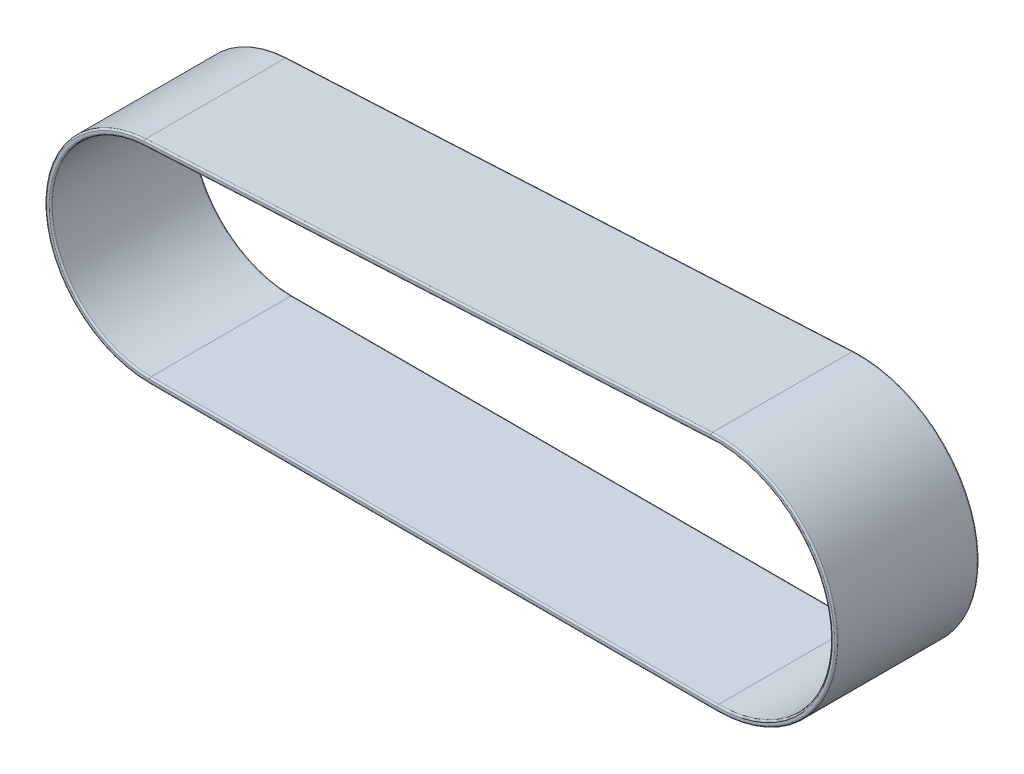
ISO-10303-21;
HEADER;
FILE_DESCRIPTION(('STEP AP214'),'2;1');
FILE_NAME('part.step','',(''),(''),'','','');
FILE_SCHEMA(('AUTOMOTIVE_DESIGN { 1 0 10303 214 1 1 1 1 }'));
ENDSEC;
DATA;
#1=APPLICATION_CONTEXT('core data for automotive mechanical design processes');
#2=APPLICATION_PROTOCOL_DEFINITION('international standard','automotive_design',2000,#1);
#3=PRODUCT_CONTEXT('',#1,'mechanical');
#4=PRODUCT('Part','Part','',(#3));
#5=PRODUCT_RELATED_PRODUCT_CATEGORY('part','',(#4));
#6=PRODUCT_DEFINITION_FORMATION('','',#4);
#7=PRODUCT_DEFINITION_CONTEXT('part definition',#1,'design');
#8=PRODUCT_DEFINITION('design','',#6,#7);
#9=PRODUCT_DEFINITION_SHAPE('','',#8);
#10=(LENGTH_UNIT() NAMED_UNIT(*) SI_UNIT(.MILLI.,.METRE.));
#11=(NAMED_UNIT(*) PLANE_ANGLE_UNIT() SI_UNIT($,.RADIAN.));
#12=(NAMED_UNIT(*) SI_UNIT($,.STERADIAN.) SOLID_ANGLE_UNIT());
#13=UNCERTAINTY_MEASURE_WITH_UNIT(LENGTH_MEASURE(1.E-05),#10,'distance_accuracy_value','');
#14=(GEOMETRIC_REPRESENTATION_CONTEXT(3) GLOBAL_UNCERTAINTY_ASSIGNED_CONTEXT((#13)) GLOBAL_UNIT_ASSIGNED_CONTEXT((#10,
#11,#12)) REPRESENTATION_CONTEXT('',''));
#15=CARTESIAN_POINT('',(0.,0.,0.));
#16=DIRECTION('',(0.,0.,1.));
#17=DIRECTION('',(1.,0.,0.));
#18=AXIS2_PLACEMENT_3D('',#15,#16,#17);
#19=CARTESIAN_POINT('',(-175.,61.,88.));
#20=DIRECTION('',(0.,0.,1.));
#21=DIRECTION('',(1.,0.,0.));
#22=AXIS2_PLACEMENT_3D('',#19,#20,#21);
#23=PLANE('',#22);
#24=DIRECTION('',(-0.998678424878244,-0.0513945880682977,0.));
#25=VECTOR('',#24,1.);
#26=CARTESIAN_POINT('',(-178.263556342337,124.416079979768,88.));
#27=LINE('',#26,#25);
#28=CARTESIAN_POINT('',(171.273892365048,142.404185803673,88.));
#29=VERTEX_POINT('',#28);
#30=CARTESIAN_POINT('',(-178.263556342337,124.416079979768,88.));
#31=VERTEX_POINT('',#30);
#32=EDGE_CURVE('E324',#29,#31,#27,.T.);
#33=ORIENTED_EDGE('',*,*,#32,.T.);
#34=CARTESIAN_POINT('',(-175.,61.,88.));
#35=DIRECTION('',(0.,0.,1.));
#36=DIRECTION('',(1.,0.,0.));
#37=AXIS2_PLACEMENT_3D('',#34,#35,#36);
#38=CIRCLE('',#37,63.5);
#39=CARTESIAN_POINT('',(-175.,-2.5,88.));
#40=VERTEX_POINT('',#39);
#41=EDGE_CURVE('E317',#31,#40,#38,.T.);
#42=ORIENTED_EDGE('',*,*,#41,.T.);
#43=DIRECTION('',(1.,0.,0.));
#44=VECTOR('',#43,1.);
#45=CARTESIAN_POINT('',(175.,-2.5,88.));
#46=LINE('',#45,#44);
#47=CARTESIAN_POINT('',(175.,-2.5,88.));
#48=VERTEX_POINT('',#47);
#49=EDGE_CURVE('E320',#40,#48,#46,.T.);
#50=ORIENTED_EDGE('',*,*,#49,.T.);
#51=CARTESIAN_POINT('',(175.,70.,88.));
#52=DIRECTION('',(0.,0.,1.));
#53=DIRECTION('',(1.,0.,0.));
#54=AXIS2_PLACEMENT_3D('',#51,#52,#53);
#55=CIRCLE('',#54,72.5);
#56=EDGE_CURVE('E327',#48,#29,#55,.T.);
#57=ORIENTED_EDGE('',*,*,#56,.T.);
#58=EDGE_LOOP('',(#33,#42,#50,#57));
#59=FACE_BOUND('',#58,.T.);
#60=CARTESIAN_POINT('',(-175.,61.,88.));
#61=DIRECTION('',(0.,0.,1.));
#62=DIRECTION('',(1.,0.,0.));
#63=AXIS2_PLACEMENT_3D('',#60,#61,#62);
#64=CIRCLE('',#63,62.);
#65=CARTESIAN_POINT('',(-175.,-1.,88.));
#66=VERTEX_POINT('',#65);
#67=CARTESIAN_POINT('',(-178.186464460234,122.918062342451,88.));
#68=VERTEX_POINT('',#67);
#69=EDGE_CURVE('E167',#66,#68,#64,.F.);
#70=ORIENTED_EDGE('',*,*,#69,.T.);
#71=DIRECTION('',(-0.998678424878244,-0.0513945880682978,0.));
#72=VECTOR('',#71,1.);
#73=CARTESIAN_POINT('',(-178.186464460234,122.918062342451,88.));
#74=LINE('',#73,#72);
#75=CARTESIAN_POINT('',(171.350984247151,140.906168166355,88.));
#76=VERTEX_POINT('',#75);
#77=EDGE_CURVE('E162',#68,#76,#74,.F.);
#78=ORIENTED_EDGE('',*,*,#77,.T.);
#79=CARTESIAN_POINT('',(175.,70.,88.));
#80=DIRECTION('',(0.,0.,1.));
#81=DIRECTION('',(1.,0.,0.));
#82=AXIS2_PLACEMENT_3D('',#79,#80,#81);
#83=CIRCLE('',#82,71.);
#84=CARTESIAN_POINT('',(175.,-0.999999999999931,88.));
#85=VERTEX_POINT('',#84);
#86=EDGE_CURVE('E157',#76,#85,#83,.F.);
#87=ORIENTED_EDGE('',*,*,#86,.T.);
#88=DIRECTION('',(1.,0.,0.));
#89=VECTOR('',#88,1.);
#90=CARTESIAN_POINT('',(-175.,-1.,88.));
#91=LINE('',#90,#89);
#92=EDGE_CURVE('E159',#85,#66,#91,.F.);
#93=ORIENTED_EDGE('',*,*,#92,.T.);
#94=EDGE_LOOP('',(#70,#78,#87,#93));
#95=FACE_BOUND('',#94,.T.);
#96=ADVANCED_FACE('F41',(#59,#95),#23,.T.);
#97=CARTESIAN_POINT('',(-175.,61.,0.));
#98=DIRECTION('',(0.,0.,1.));
#99=DIRECTION('',(1.,0.,0.));
#100=AXIS2_PLACEMENT_3D('',#97,#98,#99);
#101=PLANE('',#100);
#102=DIRECTION('',(1.,0.,0.));
#103=VECTOR('',#102,1.);
#104=CARTESIAN_POINT('',(-175.,-2.5,0.));
#105=LINE('',#104,#103);
#106=CARTESIAN_POINT('',(175.,-2.5,0.));
#107=VERTEX_POINT('',#106);
#108=CARTESIAN_POINT('',(-175.,-2.5,0.));
#109=VERTEX_POINT('',#108);
#110=EDGE_CURVE('E286',#107,#109,#105,.F.);
#111=ORIENTED_EDGE('',*,*,#110,.T.);
#112=CARTESIAN_POINT('',(-175.,61.,0.));
#113=DIRECTION('',(0.,0.,1.));
#114=DIRECTION('',(1.,0.,0.));
#115=AXIS2_PLACEMENT_3D('',#112,#113,#114);
#116=CIRCLE('',#115,63.5);
#117=CARTESIAN_POINT('',(-178.263556342337,124.416079979768,0.));
#118=VERTEX_POINT('',#117);
#119=EDGE_CURVE('E283',#109,#118,#116,.F.);
#120=ORIENTED_EDGE('',*,*,#119,.T.);
#121=DIRECTION('',(-0.998678424878244,-0.0513945880682977,0.));
#122=VECTOR('',#121,1.);
#123=CARTESIAN_POINT('',(-178.263556342337,124.416079979768,0.));
#124=LINE('',#123,#122);
#125=CARTESIAN_POINT('',(171.273892365048,142.404185803673,0.));
#126=VERTEX_POINT('',#125);
#127=EDGE_CURVE('E290',#118,#126,#124,.F.);
#128=ORIENTED_EDGE('',*,*,#127,.T.);
#129=CARTESIAN_POINT('',(175.,70.,0.));
#130=DIRECTION('',(0.,0.,1.));
#131=DIRECTION('',(1.,0.,0.));
#132=AXIS2_PLACEMENT_3D('',#129,#130,#131);
#133=CIRCLE('',#132,72.5);
#134=EDGE_CURVE('E293',#126,#107,#133,.F.);
#135=ORIENTED_EDGE('',*,*,#134,.T.);
#136=EDGE_LOOP('',(#111,#120,#128,#135));
#137=FACE_BOUND('',#136,.T.);
#138=CARTESIAN_POINT('',(175.,70.,0.));
#139=DIRECTION('',(0.,0.,1.));
#140=DIRECTION('',(1.,0.,0.));
#141=AXIS2_PLACEMENT_3D('',#138,#139,#140);
#142=CIRCLE('',#141,71.);
#143=CARTESIAN_POINT('',(175.,-0.999999999999931,0.));
#144=VERTEX_POINT('',#143);
#145=CARTESIAN_POINT('',(171.350984247151,140.906168166355,0.));
#146=VERTEX_POINT('',#145);
#147=EDGE_CURVE('E300',#144,#146,#142,.T.);
#148=ORIENTED_EDGE('',*,*,#147,.T.);
#149=DIRECTION('',(-0.998678424878244,-0.0513945880682978,0.));
#150=VECTOR('',#149,1.);
#151=CARTESIAN_POINT('',(-178.186464460234,122.918062342451,0.));
#152=LINE('',#151,#150);
#153=CARTESIAN_POINT('',(-178.186464460234,122.918062342451,0.));
#154=VERTEX_POINT('',#153);
#155=EDGE_CURVE('E296',#146,#154,#152,.T.);
#156=ORIENTED_EDGE('',*,*,#155,.T.);
#157=CARTESIAN_POINT('',(-175.,61.,0.));
#158=DIRECTION('',(0.,0.,1.));
#159=DIRECTION('',(1.,0.,0.));
#160=AXIS2_PLACEMENT_3D('',#157,#158,#159);
#161=CIRCLE('',#160,62.);
#162=CARTESIAN_POINT('',(-175.,-1.,0.));
#163=VERTEX_POINT('',#162);
#164=EDGE_CURVE('E303',#154,#163,#161,.T.);
#165=ORIENTED_EDGE('',*,*,#164,.T.);
#166=DIRECTION('',(1.,0.,0.));
#167=VECTOR('',#166,1.);
#168=CARTESIAN_POINT('',(175.,-0.999999999999931,0.));
#169=LINE('',#168,#167);
#170=EDGE_CURVE('E306',#163,#144,#169,.T.);
#171=ORIENTED_EDGE('',*,*,#170,.T.);
#172=EDGE_LOOP('',(#148,#156,#165,#171));
#173=FACE_BOUND('',#172,.T.);
#174=ADVANCED_FACE('F373',(#137,#173),#101,.F.);
#175=CARTESIAN_POINT('',(-175.,61.,88.));
#176=DIRECTION('',(0.,0.,-1.));
#177=DIRECTION('',(-1.,0.,0.));
#178=AXIS2_PLACEMENT_3D('',#175,#176,#177);
#179=CYLINDRICAL_SURFACE('',#178,64.5);
#180=DIRECTION('',(0.,0.,-1.));
#181=VECTOR('',#180,1.);
#182=CARTESIAN_POINT('',(-175.,-3.5,88.));
#183=LINE('',#182,#181);
#184=CARTESIAN_POINT('',(-175.,-3.5,87.));
#185=VERTEX_POINT('',#184);
#186=CARTESIAN_POINT('',(-175.,-3.5,1.));
#187=VERTEX_POINT('',#186);
#188=EDGE_CURVE('E179',#185,#187,#183,.T.);
#189=ORIENTED_EDGE('',*,*,#188,.F.);
#190=CARTESIAN_POINT('',(-175.,61.,87.));
#191=DIRECTION('',(0.,0.,1.));
#192=DIRECTION('',(1.,0.,0.));
#193=AXIS2_PLACEMENT_3D('',#190,#191,#192);
#194=CIRCLE('',#193,64.5);
#195=CARTESIAN_POINT('',(-178.314950930405,125.414758404647,87.));
#196=VERTEX_POINT('',#195);
#197=EDGE_CURVE('E258',#185,#196,#194,.F.);
#198=ORIENTED_EDGE('',*,*,#197,.T.);
#199=DIRECTION('',(0.,0.,-1.));
#200=VECTOR('',#199,1.);
#201=CARTESIAN_POINT('',(-178.314950930405,125.414758404647,88.));
#202=LINE('',#201,#200);
#203=CARTESIAN_POINT('',(-178.314950930405,125.414758404647,1.));
#204=VERTEX_POINT('',#203);
#205=EDGE_CURVE('E345',#196,#204,#202,.T.);
#206=ORIENTED_EDGE('',*,*,#205,.T.);
#207=CARTESIAN_POINT('',(-175.,61.,1.));
#208=DIRECTION('',(0.,0.,1.));
#209=DIRECTION('',(1.,0.,0.));
#210=AXIS2_PLACEMENT_3D('',#207,#208,#209);
#211=CIRCLE('',#210,64.5);
#212=EDGE_CURVE('E261',#204,#187,#211,.T.);
#213=ORIENTED_EDGE('',*,*,#212,.T.);
#214=EDGE_LOOP('',(#189,#198,#206,#213));
#215=FACE_BOUND('',#214,.T.);
#216=ADVANCED_FACE('F394',(#215),#179,.T.);
#217=CARTESIAN_POINT('',(-175.,-3.5,88.));
#218=DIRECTION('',(0.,1.,0.));
#219=DIRECTION('',(0.,0.,1.));
#220=AXIS2_PLACEMENT_3D('',#217,#218,#219);
#221=PLANE('',#220);
#222=DIRECTION('',(0.,0.,-1.));
#223=VECTOR('',#222,1.);
#224=CARTESIAN_POINT('',(175.,-3.5,88.));
#225=LINE('',#224,#223);
#226=CARTESIAN_POINT('',(175.,-3.5,87.));
#227=VERTEX_POINT('',#226);
#228=CARTESIAN_POINT('',(175.,-3.5,1.));
#229=VERTEX_POINT('',#228);
#230=EDGE_CURVE('E337',#227,#229,#225,.T.);
#231=ORIENTED_EDGE('',*,*,#230,.F.);
#232=DIRECTION('',(1.,0.,0.));
#233=VECTOR('',#232,1.);
#234=CARTESIAN_POINT('',(-175.,-3.5,87.));
#235=LINE('',#234,#233);
#236=EDGE_CURVE('E309',#227,#185,#235,.F.);
#237=ORIENTED_EDGE('',*,*,#236,.T.);
#238=ORIENTED_EDGE('',*,*,#188,.T.);
#239=DIRECTION('',(1.,0.,0.));
#240=VECTOR('',#239,1.);
#241=CARTESIAN_POINT('',(-175.,-3.5,1.));
#242=LINE('',#241,#240);
#243=EDGE_CURVE('E313',#187,#229,#242,.T.);
#244=ORIENTED_EDGE('',*,*,#243,.T.);
#245=EDGE_LOOP('',(#231,#237,#238,#244));
#246=FACE_BOUND('',#245,.T.);
#247=ADVANCED_FACE('F408',(#246),#221,.F.);
#248=CARTESIAN_POINT('',(175.,70.,88.));
#249=DIRECTION('',(0.,0.,-1.));
#250=DIRECTION('',(-1.,0.,0.));
#251=AXIS2_PLACEMENT_3D('',#248,#249,#250);
#252=CYLINDRICAL_SURFACE('',#251,73.5);
#253=DIRECTION('',(0.,0.,-1.));
#254=VECTOR('',#253,1.);
#255=CARTESIAN_POINT('',(171.22249777698,143.402864228551,88.));
#256=LINE('',#255,#254);
#257=CARTESIAN_POINT('',(171.22249777698,143.402864228551,87.));
#258=VERTEX_POINT('',#257);
#259=CARTESIAN_POINT('',(171.22249777698,143.402864228551,1.));
#260=VERTEX_POINT('',#259);
#261=EDGE_CURVE('E341',#258,#260,#256,.T.);
#262=ORIENTED_EDGE('',*,*,#261,.F.);
#263=CARTESIAN_POINT('',(175.,70.,87.));
#264=DIRECTION('',(0.,0.,1.));
#265=DIRECTION('',(1.,0.,0.));
#266=AXIS2_PLACEMENT_3D('',#263,#264,#265);
#267=CIRCLE('',#266,73.5);
#268=EDGE_CURVE('E252',#258,#227,#267,.F.);
#269=ORIENTED_EDGE('',*,*,#268,.T.);
#270=ORIENTED_EDGE('',*,*,#230,.T.);
#271=CARTESIAN_POINT('',(175.,70.,1.));
#272=DIRECTION('',(0.,0.,1.));
#273=DIRECTION('',(1.,0.,0.));
#274=AXIS2_PLACEMENT_3D('',#271,#272,#273);
#275=CIRCLE('',#274,73.5);
#276=EDGE_CURVE('E255',#229,#260,#275,.T.);
#277=ORIENTED_EDGE('',*,*,#276,.T.);
#278=EDGE_LOOP('',(#262,#269,#270,#277));
#279=FACE_BOUND('',#278,.T.);
#280=ADVANCED_FACE('F404',(#279),#252,.T.);
#281=CARTESIAN_POINT('',(171.22249777698,143.402864228551,88.));
#282=DIRECTION('',(0.0513945880682977,-0.998678424878244,0.));
#283=DIRECTION('',(0.998678424878244,0.0513945880682977,0.));
#284=AXIS2_PLACEMENT_3D('',#281,#282,#283);
#285=PLANE('',#284);
#286=ORIENTED_EDGE('',*,*,#205,.F.);
#287=DIRECTION('',(-0.998678424878244,-0.0513945880682977,0.));
#288=VECTOR('',#287,1.);
#289=CARTESIAN_POINT('',(171.22249777698,143.402864228551,87.));
#290=LINE('',#289,#288);
#291=EDGE_CURVE('E269',#196,#258,#290,.F.);
#292=ORIENTED_EDGE('',*,*,#291,.T.);
#293=ORIENTED_EDGE('',*,*,#261,.T.);
#294=DIRECTION('',(-0.998678424878244,-0.0513945880682977,0.));
#295=VECTOR('',#294,1.);
#296=CARTESIAN_POINT('',(171.22249777698,143.402864228551,1.));
#297=LINE('',#296,#295);
#298=EDGE_CURVE('E272',#260,#204,#297,.T.);
#299=ORIENTED_EDGE('',*,*,#298,.T.);
#300=EDGE_LOOP('',(#286,#292,#293,#299));
#301=FACE_BOUND('',#300,.T.);
#302=ADVANCED_FACE('F401',(#301),#285,.F.);
#303=CARTESIAN_POINT('',(-175.,61.,88.));
#304=DIRECTION('',(0.,0.,-1.));
#305=DIRECTION('',(-1.,0.,0.));
#306=AXIS2_PLACEMENT_3D('',#303,#304,#305);
#307=CYLINDRICAL_SURFACE('',#306,61.);
#308=DIRECTION('',(0.,0.,-1.));
#309=VECTOR('',#308,1.);
#310=CARTESIAN_POINT('',(-178.135069872166,121.919383917573,88.));
#311=LINE('',#310,#309);
#312=CARTESIAN_POINT('',(-178.135069872166,121.919383917573,87.));
#313=VERTEX_POINT('',#312);
#314=CARTESIAN_POINT('',(-178.135069872166,121.919383917573,1.));
#315=VERTEX_POINT('',#314);
#316=EDGE_CURVE('E235',#313,#315,#311,.T.);
#317=ORIENTED_EDGE('',*,*,#316,.F.);
#318=CARTESIAN_POINT('',(-175.,61.,87.));
#319=DIRECTION('',(0.,0.,1.));
#320=DIRECTION('',(1.,0.,0.));
#321=AXIS2_PLACEMENT_3D('',#318,#319,#320);
#322=CIRCLE('',#321,61.);
#323=CARTESIAN_POINT('',(-175.,0.,87.));
#324=VERTEX_POINT('',#323);
#325=EDGE_CURVE('E65',#313,#324,#322,.T.);
#326=ORIENTED_EDGE('',*,*,#325,.T.);
#327=DIRECTION('',(0.,0.,-1.));
#328=VECTOR('',#327,1.);
#329=CARTESIAN_POINT('',(-175.,0.,88.));
#330=LINE('',#329,#328);
#331=CARTESIAN_POINT('',(-175.,0.,1.));
#332=VERTEX_POINT('',#331);
#333=EDGE_CURVE('E349',#324,#332,#330,.T.);
#334=ORIENTED_EDGE('',*,*,#333,.T.);
#335=CARTESIAN_POINT('',(-175.,61.,1.));
#336=DIRECTION('',(0.,0.,1.));
#337=DIRECTION('',(1.,0.,0.));
#338=AXIS2_PLACEMENT_3D('',#335,#336,#337);
#339=CIRCLE('',#338,61.);
#340=EDGE_CURVE('E249',#332,#315,#339,.F.);
#341=ORIENTED_EDGE('',*,*,#340,.T.);
#342=EDGE_LOOP('',(#317,#326,#334,#341));
#343=FACE_BOUND('',#342,.T.);
#344=ADVANCED_FACE('F398',(#343),#307,.F.);
#345=CARTESIAN_POINT('',(-175.,0.,88.));
#346=DIRECTION('',(0.,1.,0.));
#347=DIRECTION('',(-1.,0.,0.));
#348=AXIS2_PLACEMENT_3D('',#345,#346,#347);
#349=PLANE('',#348);
#350=ORIENTED_EDGE('',*,*,#333,.F.);
#351=DIRECTION('',(1.,0.,0.));
#352=VECTOR('',#351,1.);
#353=CARTESIAN_POINT('',(-175.,0.,87.));
#354=LINE('',#353,#352);
#355=CARTESIAN_POINT('',(175.,0.,87.));
#356=VERTEX_POINT('',#355);
#357=EDGE_CURVE('E11',#324,#356,#354,.T.);
#358=ORIENTED_EDGE('',*,*,#357,.T.);
#359=DIRECTION('',(0.,0.,-1.));
#360=VECTOR('',#359,1.);
#361=CARTESIAN_POINT('',(175.,0.,88.));
#362=LINE('',#361,#360);
#363=CARTESIAN_POINT('',(175.,0.,1.));
#364=VERTEX_POINT('',#363);
#365=EDGE_CURVE('E352',#356,#364,#362,.T.);
#366=ORIENTED_EDGE('',*,*,#365,.T.);
#367=DIRECTION('',(1.,0.,0.));
#368=VECTOR('',#367,1.);
#369=CARTESIAN_POINT('',(-175.,0.,1.));
#370=LINE('',#369,#368);
#371=EDGE_CURVE('E51',#364,#332,#370,.F.);
#372=ORIENTED_EDGE('',*,*,#371,.T.);
#373=EDGE_LOOP('',(#350,#358,#366,#372));
#374=FACE_BOUND('',#373,.T.);
#375=ADVANCED_FACE('F378',(#374),#349,.T.);
#376=CARTESIAN_POINT('',(175.,70.,88.));
#377=DIRECTION('',(0.,0.,-1.));
#378=DIRECTION('',(-1.,0.,0.));
#379=AXIS2_PLACEMENT_3D('',#376,#377,#378);
#380=CYLINDRICAL_SURFACE('',#379,70.);
#381=ORIENTED_EDGE('',*,*,#365,.F.);
#382=CARTESIAN_POINT('',(175.,70.,87.));
#383=DIRECTION('',(0.,0.,1.));
#384=DIRECTION('',(1.,0.,0.));
#385=AXIS2_PLACEMENT_3D('',#382,#383,#384);
#386=CIRCLE('',#385,70.);
#387=CARTESIAN_POINT('',(171.402378835219,139.907489741477,87.));
#388=VERTEX_POINT('',#387);
#389=EDGE_CURVE('E182',#356,#388,#386,.T.);
#390=ORIENTED_EDGE('',*,*,#389,.T.);
#391=DIRECTION('',(0.,0.,-1.));
#392=VECTOR('',#391,1.);
#393=CARTESIAN_POINT('',(171.402378835219,139.907489741477,88.));
#394=LINE('',#393,#392);
#395=CARTESIAN_POINT('',(171.402378835219,139.907489741477,1.));
#396=VERTEX_POINT('',#395);
#397=EDGE_CURVE('E355',#388,#396,#394,.T.);
#398=ORIENTED_EDGE('',*,*,#397,.T.);
#399=CARTESIAN_POINT('',(175.,70.,1.));
#400=DIRECTION('',(0.,0.,1.));
#401=DIRECTION('',(1.,0.,0.));
#402=AXIS2_PLACEMENT_3D('',#399,#400,#401);
#403=CIRCLE('',#402,70.);
#404=EDGE_CURVE('E266',#396,#364,#403,.F.);
#405=ORIENTED_EDGE('',*,*,#404,.T.);
#406=EDGE_LOOP('',(#381,#390,#398,#405));
#407=FACE_BOUND('',#406,.T.);
#408=ADVANCED_FACE('F377',(#407),#380,.F.);
#409=CARTESIAN_POINT('',(171.402378835219,139.907489741477,88.));
#410=DIRECTION('',(0.0513945880682978,-0.998678424878244,0.));
#411=DIRECTION('',(0.998678424878244,0.0513945880682978,0.));
#412=AXIS2_PLACEMENT_3D('',#409,#410,#411);
#413=PLANE('',#412);
#414=ORIENTED_EDGE('',*,*,#397,.F.);
#415=DIRECTION('',(-0.998678424878244,-0.0513945880682978,0.));
#416=VECTOR('',#415,1.);
#417=CARTESIAN_POINT('',(171.402378835219,139.907489741477,87.));
#418=LINE('',#417,#416);
#419=EDGE_CURVE('E275',#388,#313,#418,.T.);
#420=ORIENTED_EDGE('',*,*,#419,.T.);
#421=ORIENTED_EDGE('',*,*,#316,.T.);
#422=DIRECTION('',(-0.998678424878244,-0.0513945880682978,0.));
#423=VECTOR('',#422,1.);
#424=CARTESIAN_POINT('',(171.402378835219,139.907489741477,1.));
#425=LINE('',#424,#423);
#426=EDGE_CURVE('E279',#315,#396,#425,.F.);
#427=ORIENTED_EDGE('',*,*,#426,.T.);
#428=EDGE_LOOP('',(#414,#420,#421,#427));
#429=FACE_BOUND('',#428,.T.);
#430=ADVANCED_FACE('F364',(#429),#413,.T.);
#431=CARTESIAN_POINT('',(-178.263556342337,124.416079979768,87.));
#432=DIRECTION('',(0.998678424878244,0.0513945880682977,0.));
#433=DIRECTION('',(-0.0513945880682977,0.998678424878244,0.));
#434=AXIS2_PLACEMENT_3D('',#431,#432,#433);
#435=CYLINDRICAL_SURFACE('',#434,1.);
#436=CARTESIAN_POINT('',(171.273892365048,142.404185803673,87.));
#437=DIRECTION('',(0.998678424878244,0.0513945880682985,0.));
#438=DIRECTION('',(-0.0513945880682985,0.998678424878244,0.));
#439=AXIS2_PLACEMENT_3D('',#436,#437,#438);
#440=CIRCLE('',#439,1.);
#441=EDGE_CURVE('E236',#258,#29,#440,.T.);
#442=ORIENTED_EDGE('',*,*,#441,.F.);
#443=ORIENTED_EDGE('',*,*,#291,.F.);
#444=CARTESIAN_POINT('',(-178.263556342337,124.416079979768,87.));
#445=DIRECTION('',(-0.998678424878244,-0.0513945880682985,0.));
#446=DIRECTION('',(0.0513945880682985,-0.998678424878244,0.));
#447=AXIS2_PLACEMENT_3D('',#444,#445,#446);
#448=CIRCLE('',#447,1.);
#449=EDGE_CURVE('E231',#31,#196,#448,.T.);
#450=ORIENTED_EDGE('',*,*,#449,.F.);
#451=ORIENTED_EDGE('',*,*,#32,.F.);
#452=EDGE_LOOP('',(#442,#443,#450,#451));
#453=FACE_BOUND('',#452,.T.);
#454=ADVANCED_FACE('F428',(#453),#435,.T.);
#455=CARTESIAN_POINT('',(-175.,61.,87.));
#456=DIRECTION('',(0.,0.,1.));
#457=DIRECTION('',(1.,0.,0.));
#458=AXIS2_PLACEMENT_3D('',#455,#456,#457);
#459=TOROIDAL_SURFACE('',#458,63.5,1.);
#460=ORIENTED_EDGE('',*,*,#449,.T.);
#461=ORIENTED_EDGE('',*,*,#197,.F.);
#462=CARTESIAN_POINT('',(-175.,-2.5,87.));
#463=DIRECTION('',(1.,0.,0.));
#464=DIRECTION('',(0.,0.,-1.));
#465=AXIS2_PLACEMENT_3D('',#462,#463,#464);
#466=CIRCLE('',#465,1.);
#467=EDGE_CURVE('E240',#40,#185,#466,.T.);
#468=ORIENTED_EDGE('',*,*,#467,.F.);
#469=ORIENTED_EDGE('',*,*,#41,.F.);
#470=EDGE_LOOP('',(#460,#461,#468,#469));
#471=FACE_BOUND('',#470,.T.);
#472=ADVANCED_FACE('F424',(#471),#459,.T.);
#473=CARTESIAN_POINT('',(175.,70.,87.));
#474=DIRECTION('',(0.,0.,1.));
#475=DIRECTION('',(1.,0.,0.));
#476=AXIS2_PLACEMENT_3D('',#473,#474,#475);
#477=TOROIDAL_SURFACE('',#476,72.5,1.);
#478=ORIENTED_EDGE('',*,*,#441,.T.);
#479=ORIENTED_EDGE('',*,*,#56,.F.);
#480=CARTESIAN_POINT('',(175.,-2.5,87.));
#481=DIRECTION('',(-1.,0.,0.));
#482=DIRECTION('',(0.,0.,1.));
#483=AXIS2_PLACEMENT_3D('',#480,#481,#482);
#484=CIRCLE('',#483,1.);
#485=EDGE_CURVE('E224',#227,#48,#484,.T.);
#486=ORIENTED_EDGE('',*,*,#485,.F.);
#487=ORIENTED_EDGE('',*,*,#268,.F.);
#488=EDGE_LOOP('',(#478,#479,#486,#487));
#489=FACE_BOUND('',#488,.T.);
#490=ADVANCED_FACE('F420',(#489),#477,.T.);
#491=CARTESIAN_POINT('',(-175.,-2.5,87.));
#492=DIRECTION('',(-1.,0.,0.));
#493=DIRECTION('',(0.,0.,1.));
#494=AXIS2_PLACEMENT_3D('',#491,#492,#493);
#495=CYLINDRICAL_SURFACE('',#494,1.);
#496=ORIENTED_EDGE('',*,*,#467,.T.);
#497=ORIENTED_EDGE('',*,*,#236,.F.);
#498=ORIENTED_EDGE('',*,*,#485,.T.);
#499=ORIENTED_EDGE('',*,*,#49,.F.);
#500=EDGE_LOOP('',(#496,#497,#498,#499));
#501=FACE_BOUND('',#500,.T.);
#502=ADVANCED_FACE('F416',(#501),#495,.T.);
#503=CARTESIAN_POINT('',(171.273892365048,142.404185803673,1.));
#504=DIRECTION('',(-0.998678424878244,-0.0513945880682977,0.));
#505=DIRECTION('',(0.0513945880682977,-0.998678424878244,0.));
#506=AXIS2_PLACEMENT_3D('',#503,#504,#505);
#507=CYLINDRICAL_SURFACE('',#506,1.);
#508=CARTESIAN_POINT('',(171.273892365048,142.404185803673,1.));
#509=DIRECTION('',(0.998678424878244,0.0513945880682985,0.));
#510=DIRECTION('',(-0.0513945880682985,0.998678424878244,0.));
#511=AXIS2_PLACEMENT_3D('',#508,#509,#510);
#512=CIRCLE('',#511,1.);
#513=EDGE_CURVE('E225',#126,#260,#512,.T.);
#514=ORIENTED_EDGE('',*,*,#513,.F.);
#515=ORIENTED_EDGE('',*,*,#127,.F.);
#516=CARTESIAN_POINT('',(-178.263556342337,124.416079979768,1.));
#517=DIRECTION('',(-0.998678424878244,-0.0513945880682985,0.));
#518=DIRECTION('',(0.0513945880682985,-0.998678424878244,0.));
#519=AXIS2_PLACEMENT_3D('',#516,#517,#518);
#520=CIRCLE('',#519,1.);
#521=EDGE_CURVE('E220',#204,#118,#520,.T.);
#522=ORIENTED_EDGE('',*,*,#521,.F.);
#523=ORIENTED_EDGE('',*,*,#298,.F.);
#524=EDGE_LOOP('',(#514,#515,#522,#523));
#525=FACE_BOUND('',#524,.T.);
#526=ADVANCED_FACE('F419',(#525),#507,.T.);
#527=CARTESIAN_POINT('',(-175.,61.,1.));
#528=DIRECTION('',(0.,0.,1.));
#529=DIRECTION('',(1.,0.,0.));
#530=AXIS2_PLACEMENT_3D('',#527,#528,#529);
#531=TOROIDAL_SURFACE('',#530,63.5,1.);
#532=ORIENTED_EDGE('',*,*,#521,.T.);
#533=ORIENTED_EDGE('',*,*,#119,.F.);
#534=CARTESIAN_POINT('',(-175.,-2.5,1.));
#535=DIRECTION('',(1.,0.,0.));
#536=DIRECTION('',(0.,0.,-1.));
#537=AXIS2_PLACEMENT_3D('',#534,#535,#536);
#538=CIRCLE('',#537,1.);
#539=EDGE_CURVE('E188',#187,#109,#538,.T.);
#540=ORIENTED_EDGE('',*,*,#539,.F.);
#541=ORIENTED_EDGE('',*,*,#212,.F.);
#542=EDGE_LOOP('',(#532,#533,#540,#541));
#543=FACE_BOUND('',#542,.T.);
#544=ADVANCED_FACE('F440',(#543),#531,.T.);
#545=CARTESIAN_POINT('',(175.,70.,1.));
#546=DIRECTION('',(0.,0.,1.));
#547=DIRECTION('',(1.,0.,0.));
#548=AXIS2_PLACEMENT_3D('',#545,#546,#547);
#549=TOROIDAL_SURFACE('',#548,72.5,1.);
#550=ORIENTED_EDGE('',*,*,#513,.T.);
#551=ORIENTED_EDGE('',*,*,#276,.F.);
#552=CARTESIAN_POINT('',(175.,-2.5,1.));
#553=DIRECTION('',(-1.,0.,0.));
#554=DIRECTION('',(0.,0.,1.));
#555=AXIS2_PLACEMENT_3D('',#552,#553,#554);
#556=CIRCLE('',#555,1.);
#557=EDGE_CURVE('E184',#107,#229,#556,.T.);
#558=ORIENTED_EDGE('',*,*,#557,.F.);
#559=ORIENTED_EDGE('',*,*,#134,.F.);
#560=EDGE_LOOP('',(#550,#551,#558,#559));
#561=FACE_BOUND('',#560,.T.);
#562=ADVANCED_FACE('F436',(#561),#549,.T.);
#563=CARTESIAN_POINT('',(-175.,-2.5,1.));
#564=DIRECTION('',(1.,0.,0.));
#565=DIRECTION('',(0.,0.,-1.));
#566=AXIS2_PLACEMENT_3D('',#563,#564,#565);
#567=CYLINDRICAL_SURFACE('',#566,1.);
#568=ORIENTED_EDGE('',*,*,#539,.T.);
#569=ORIENTED_EDGE('',*,*,#110,.F.);
#570=ORIENTED_EDGE('',*,*,#557,.T.);
#571=ORIENTED_EDGE('',*,*,#243,.F.);
#572=EDGE_LOOP('',(#568,#569,#570,#571));
#573=FACE_BOUND('',#572,.T.);
#574=ADVANCED_FACE('F433',(#573),#567,.T.);
#575=CARTESIAN_POINT('',(-175.,-1.,87.));
#576=DIRECTION('',(1.,0.,0.));
#577=DIRECTION('',(0.,1.,0.));
#578=AXIS2_PLACEMENT_3D('',#575,#576,#577);
#579=CYLINDRICAL_SURFACE('',#578,1.);
#580=CARTESIAN_POINT('',(-175.,-1.,87.));
#581=DIRECTION('',(-1.,0.,0.));
#582=DIRECTION('',(0.,0.,1.));
#583=AXIS2_PLACEMENT_3D('',#580,#581,#582);
#584=CIRCLE('',#583,1.);
#585=EDGE_CURVE('E176',#66,#324,#584,.T.);
#586=ORIENTED_EDGE('',*,*,#585,.F.);
#587=ORIENTED_EDGE('',*,*,#92,.F.);
#588=CARTESIAN_POINT('',(175.,-0.999999999999931,87.));
#589=DIRECTION('',(1.,0.,0.));
#590=DIRECTION('',(0.,0.,-1.));
#591=AXIS2_PLACEMENT_3D('',#588,#589,#590);
#592=CIRCLE('',#591,1.);
#593=EDGE_CURVE('E173',#356,#85,#592,.T.);
#594=ORIENTED_EDGE('',*,*,#593,.F.);
#595=ORIENTED_EDGE('',*,*,#357,.F.);
#596=EDGE_LOOP('',(#586,#587,#594,#595));
#597=FACE_BOUND('',#596,.T.);
#598=ADVANCED_FACE('F171',(#597),#579,.T.);
#599=CARTESIAN_POINT('',(175.,70.,87.));
#600=DIRECTION('',(0.,0.,1.));
#601=DIRECTION('',(1.,0.,0.));
#602=AXIS2_PLACEMENT_3D('',#599,#600,#601);
#603=TOROIDAL_SURFACE('',#602,71.,1.);
#604=ORIENTED_EDGE('',*,*,#593,.T.);
#605=ORIENTED_EDGE('',*,*,#86,.F.);
#606=CARTESIAN_POINT('',(171.350984247151,140.906168166355,87.));
#607=DIRECTION('',(-0.998678424878244,-0.0513945880682985,0.));
#608=DIRECTION('',(0.0513945880682985,-0.998678424878244,0.));
#609=AXIS2_PLACEMENT_3D('',#606,#607,#608);
#610=CIRCLE('',#609,1.);
#611=EDGE_CURVE('E190',#388,#76,#610,.T.);
#612=ORIENTED_EDGE('',*,*,#611,.F.);
#613=ORIENTED_EDGE('',*,*,#389,.F.);
#614=EDGE_LOOP('',(#604,#605,#612,#613));
#615=FACE_BOUND('',#614,.T.);
#616=ADVANCED_FACE('F181',(#615),#603,.T.);
#617=CARTESIAN_POINT('',(-175.,61.,87.));
#618=DIRECTION('',(0.,0.,1.));
#619=DIRECTION('',(1.,0.,0.));
#620=AXIS2_PLACEMENT_3D('',#617,#618,#619);
#621=TOROIDAL_SURFACE('',#620,62.,1.);
#622=ORIENTED_EDGE('',*,*,#585,.T.);
#623=ORIENTED_EDGE('',*,*,#325,.F.);
#624=CARTESIAN_POINT('',(-178.186464460234,122.918062342451,87.));
#625=DIRECTION('',(0.998678424878244,0.0513945880682992,0.));
#626=DIRECTION('',(-0.0513945880682992,0.998678424878244,0.));
#627=AXIS2_PLACEMENT_3D('',#624,#625,#626);
#628=CIRCLE('',#627,1.);
#629=EDGE_CURVE('E208',#68,#313,#628,.T.);
#630=ORIENTED_EDGE('',*,*,#629,.F.);
#631=ORIENTED_EDGE('',*,*,#69,.F.);
#632=EDGE_LOOP('',(#622,#623,#630,#631));
#633=FACE_BOUND('',#632,.T.);
#634=ADVANCED_FACE('F386',(#633),#621,.T.);
#635=CARTESIAN_POINT('',(171.350984247151,140.906168166355,87.));
#636=DIRECTION('',(-0.998678424878244,-0.0513945880682978,0.));
#637=DIRECTION('',(0.0513945880682978,-0.998678424878244,0.));
#638=AXIS2_PLACEMENT_3D('',#635,#636,#637);
#639=CYLINDRICAL_SURFACE('',#638,1.);
#640=ORIENTED_EDGE('',*,*,#611,.T.);
#641=ORIENTED_EDGE('',*,*,#77,.F.);
#642=ORIENTED_EDGE('',*,*,#629,.T.);
#643=ORIENTED_EDGE('',*,*,#419,.F.);
#644=EDGE_LOOP('',(#640,#641,#642,#643));
#645=FACE_BOUND('',#644,.T.);
#646=ADVANCED_FACE('F381',(#645),#639,.T.);
#647=CARTESIAN_POINT('',(-175.,-1.,1.));
#648=DIRECTION('',(-1.,0.,0.));
#649=DIRECTION('',(0.,-1.,0.));
#650=AXIS2_PLACEMENT_3D('',#647,#648,#649);
#651=CYLINDRICAL_SURFACE('',#650,1.);
#652=CARTESIAN_POINT('',(-175.,-1.,1.));
#653=DIRECTION('',(-1.,0.,0.));
#654=DIRECTION('',(0.,0.,1.));
#655=AXIS2_PLACEMENT_3D('',#652,#653,#654);
#656=CIRCLE('',#655,1.);
#657=EDGE_CURVE('E199',#332,#163,#656,.T.);
#658=ORIENTED_EDGE('',*,*,#657,.F.);
#659=ORIENTED_EDGE('',*,*,#371,.F.);
#660=CARTESIAN_POINT('',(175.,-0.999999999999931,1.));
#661=DIRECTION('',(1.,0.,0.));
#662=DIRECTION('',(0.,0.,-1.));
#663=AXIS2_PLACEMENT_3D('',#660,#661,#662);
#664=CIRCLE('',#663,1.);
#665=EDGE_CURVE('E45',#144,#364,#664,.T.);
#666=ORIENTED_EDGE('',*,*,#665,.F.);
#667=ORIENTED_EDGE('',*,*,#170,.F.);
#668=EDGE_LOOP('',(#658,#659,#666,#667));
#669=FACE_BOUND('',#668,.T.);
#670=ADVANCED_FACE('F43',(#669),#651,.T.);
#671=CARTESIAN_POINT('',(175.,70.,1.));
#672=DIRECTION('',(0.,0.,1.));
#673=DIRECTION('',(1.,0.,0.));
#674=AXIS2_PLACEMENT_3D('',#671,#672,#673);
#675=TOROIDAL_SURFACE('',#674,71.,1.);
#676=ORIENTED_EDGE('',*,*,#665,.T.);
#677=ORIENTED_EDGE('',*,*,#404,.F.);
#678=CARTESIAN_POINT('',(171.350984247151,140.906168166355,1.));
#679=DIRECTION('',(-0.998678424878244,-0.0513945880682985,0.));
#680=DIRECTION('',(0.0513945880682985,-0.998678424878244,0.));
#681=AXIS2_PLACEMENT_3D('',#678,#679,#680);
#682=CIRCLE('',#681,1.);
#683=EDGE_CURVE('E197',#146,#396,#682,.T.);
#684=ORIENTED_EDGE('',*,*,#683,.F.);
#685=ORIENTED_EDGE('',*,*,#147,.F.);
#686=EDGE_LOOP('',(#676,#677,#684,#685));
#687=FACE_BOUND('',#686,.T.);
#688=ADVANCED_FACE('F374',(#687),#675,.T.);
#689=CARTESIAN_POINT('',(-175.,61.,1.));
#690=DIRECTION('',(0.,0.,1.));
#691=DIRECTION('',(1.,0.,0.));
#692=AXIS2_PLACEMENT_3D('',#689,#690,#691);
#693=TOROIDAL_SURFACE('',#692,62.,1.);
#694=ORIENTED_EDGE('',*,*,#657,.T.);
#695=ORIENTED_EDGE('',*,*,#164,.F.);
#696=CARTESIAN_POINT('',(-178.186464460234,122.918062342451,1.));
#697=DIRECTION('',(0.998678424878244,0.0513945880682985,0.));
#698=DIRECTION('',(-0.0513945880682985,0.998678424878244,0.));
#699=AXIS2_PLACEMENT_3D('',#696,#697,#698);
#700=CIRCLE('',#699,1.);
#701=EDGE_CURVE('E194',#315,#154,#700,.T.);
#702=ORIENTED_EDGE('',*,*,#701,.F.);
#703=ORIENTED_EDGE('',*,*,#340,.F.);
#704=EDGE_LOOP('',(#694,#695,#702,#703));
#705=FACE_BOUND('',#704,.T.);
#706=ADVANCED_FACE('F370',(#705),#693,.T.);
#707=CARTESIAN_POINT('',(-178.186464460234,122.918062342451,1.));
#708=DIRECTION('',(0.998678424878244,0.0513945880682978,0.));
#709=DIRECTION('',(-0.0513945880682978,0.998678424878244,0.));
#710=AXIS2_PLACEMENT_3D('',#707,#708,#709);
#711=CYLINDRICAL_SURFACE('',#710,1.);
#712=ORIENTED_EDGE('',*,*,#683,.T.);
#713=ORIENTED_EDGE('',*,*,#426,.F.);
#714=ORIENTED_EDGE('',*,*,#701,.T.);
#715=ORIENTED_EDGE('',*,*,#155,.F.);
#716=EDGE_LOOP('',(#712,#713,#714,#715));
#717=FACE_BOUND('',#716,.T.);
#718=ADVANCED_FACE('F367',(#717),#711,.T.);
#719=CLOSED_SHELL('',(#96,#174,#216,#247,#280,#302,#344,#375,#408,#430,#454,#472,#490,#502,#526,
#544,#562,#574,#598,#616,#634,#646,#670,#688,#706,#718));
#720=MANIFOLD_SOLID_BREP('B2',#719);
#721=ADVANCED_BREP_SHAPE_REPRESENTATION('',(#18,#720),#14);
#722=SHAPE_DEFINITION_REPRESENTATION(#9,#721);
ENDSEC;
END-ISO-10303-21;
